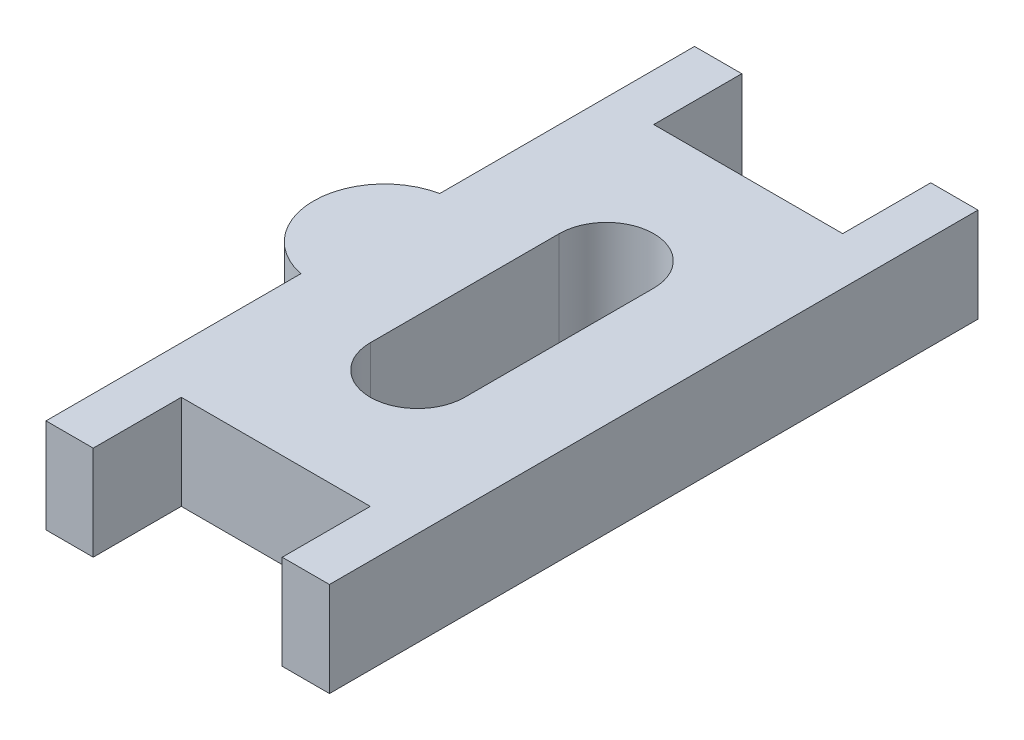
ISO-10303-21;
HEADER;
FILE_DESCRIPTION(('STEP AP214'),'2;1');
FILE_NAME('part.step','',(''),(''),'','','');
FILE_SCHEMA(('AUTOMOTIVE_DESIGN { 1 0 10303 214 1 1 1 1 }'));
ENDSEC;
DATA;
#1=APPLICATION_CONTEXT('core data for automotive mechanical design processes');
#2=APPLICATION_PROTOCOL_DEFINITION('international standard','automotive_design',2000,#1);
#3=PRODUCT_CONTEXT('',#1,'mechanical');
#4=PRODUCT('Part','Part','',(#3));
#5=PRODUCT_RELATED_PRODUCT_CATEGORY('part','',(#4));
#6=PRODUCT_DEFINITION_FORMATION('','',#4);
#7=PRODUCT_DEFINITION_CONTEXT('part definition',#1,'design');
#8=PRODUCT_DEFINITION('design','',#6,#7);
#9=PRODUCT_DEFINITION_SHAPE('','',#8);
#10=(LENGTH_UNIT() NAMED_UNIT(*) SI_UNIT(.MILLI.,.METRE.));
#11=(NAMED_UNIT(*) PLANE_ANGLE_UNIT() SI_UNIT($,.RADIAN.));
#12=(NAMED_UNIT(*) SI_UNIT($,.STERADIAN.) SOLID_ANGLE_UNIT());
#13=UNCERTAINTY_MEASURE_WITH_UNIT(LENGTH_MEASURE(1.E-05),#10,'distance_accuracy_value','');
#14=(GEOMETRIC_REPRESENTATION_CONTEXT(3) GLOBAL_UNCERTAINTY_ASSIGNED_CONTEXT((#13)) GLOBAL_UNIT_ASSIGNED_CONTEXT((#10,
#11,#12)) REPRESENTATION_CONTEXT('',''));
#15=CARTESIAN_POINT('',(0.,0.,0.));
#16=DIRECTION('',(0.,0.,1.));
#17=DIRECTION('',(1.,0.,0.));
#18=AXIS2_PLACEMENT_3D('',#15,#16,#17);
#19=CARTESIAN_POINT('',(-3.175,3.175,-10.8966));
#20=DIRECTION('',(0.,0.,1.));
#21=DIRECTION('',(1.,0.,0.));
#22=AXIS2_PLACEMENT_3D('',#19,#20,#21);
#23=PLANE('',#22);
#24=DIRECTION('',(-1.,0.,0.));
#25=VECTOR('',#24,1.);
#26=CARTESIAN_POINT('',(-3.175,0.,-10.8966));
#27=LINE('',#26,#25);
#28=CARTESIAN_POINT('',(-3.175,0.,-10.8966));
#29=VERTEX_POINT('',#28);
#30=CARTESIAN_POINT('',(-4.7625,0.,-10.8966));
#31=VERTEX_POINT('',#30);
#32=EDGE_CURVE('E171',#29,#31,#27,.T.);
#33=ORIENTED_EDGE('',*,*,#32,.T.);
#34=DIRECTION('',(0.,-1.,0.));
#35=VECTOR('',#34,1.);
#36=CARTESIAN_POINT('',(-4.7625,3.175,-10.8966));
#37=LINE('',#36,#35);
#38=CARTESIAN_POINT('',(-4.7625,3.175,-10.8966));
#39=VERTEX_POINT('',#38);
#40=EDGE_CURVE('E11',#39,#31,#37,.T.);
#41=ORIENTED_EDGE('',*,*,#40,.F.);
#42=DIRECTION('',(-1.,0.,0.));
#43=VECTOR('',#42,1.);
#44=CARTESIAN_POINT('',(-3.175,3.175,-10.8966));
#45=LINE('',#44,#43);
#46=CARTESIAN_POINT('',(-3.175,3.175,-10.8966));
#47=VERTEX_POINT('',#46);
#48=EDGE_CURVE('E194',#47,#39,#45,.T.);
#49=ORIENTED_EDGE('',*,*,#48,.F.);
#50=DIRECTION('',(0.,-1.,0.));
#51=VECTOR('',#50,1.);
#52=CARTESIAN_POINT('',(-3.175,3.175,-10.8966));
#53=LINE('',#52,#51);
#54=EDGE_CURVE('E224',#47,#29,#53,.T.);
#55=ORIENTED_EDGE('',*,*,#54,.T.);
#56=EDGE_LOOP('',(#33,#41,#49,#55));
#57=FACE_BOUND('',#56,.T.);
#58=ADVANCED_FACE('F33',(#57),#23,.F.);
#59=CARTESIAN_POINT('',(-4.7625,3.175,-10.8966));
#60=DIRECTION('',(1.,0.,0.));
#61=DIRECTION('',(0.,0.,-1.));
#62=AXIS2_PLACEMENT_3D('',#59,#60,#61);
#63=PLANE('',#62);
#64=DIRECTION('',(0.,0.,1.));
#65=VECTOR('',#64,1.);
#66=CARTESIAN_POINT('',(-4.7625,0.,-10.8966));
#67=LINE('',#66,#65);
#68=CARTESIAN_POINT('',(-4.7625,0.,-2.33313898000098));
#69=VERTEX_POINT('',#68);
#70=EDGE_CURVE('E227',#31,#69,#67,.T.);
#71=ORIENTED_EDGE('',*,*,#70,.T.);
#72=DIRECTION('',(0.,-1.,0.));
#73=VECTOR('',#72,1.);
#74=CARTESIAN_POINT('',(-4.7625,3.175,-2.33313898000098));
#75=LINE('',#74,#73);
#76=CARTESIAN_POINT('',(-4.7625,3.175,-2.33313898000098));
#77=VERTEX_POINT('',#76);
#78=EDGE_CURVE('E40',#77,#69,#75,.T.);
#79=ORIENTED_EDGE('',*,*,#78,.F.);
#80=DIRECTION('',(0.,0.,1.));
#81=VECTOR('',#80,1.);
#82=CARTESIAN_POINT('',(-4.7625,3.175,-10.8966));
#83=LINE('',#82,#81);
#84=EDGE_CURVE('E197',#39,#77,#83,.T.);
#85=ORIENTED_EDGE('',*,*,#84,.F.);
#86=ORIENTED_EDGE('',*,*,#40,.T.);
#87=EDGE_LOOP('',(#71,#79,#85,#86));
#88=FACE_BOUND('',#87,.T.);
#89=ADVANCED_FACE('F312',(#88),#63,.F.);
#90=CARTESIAN_POINT('',(-4.28625,3.175,0.));
#91=DIRECTION('',(0.,-1.,0.));
#92=DIRECTION('',(0.,0.,-1.));
#93=AXIS2_PLACEMENT_3D('',#90,#91,#92);
#94=CYLINDRICAL_SURFACE('',#93,2.38125);
#95=CARTESIAN_POINT('',(-4.28625,0.,0.));
#96=DIRECTION('',(0.,1.,0.));
#97=DIRECTION('',(0.,0.,1.));
#98=AXIS2_PLACEMENT_3D('',#95,#96,#97);
#99=CIRCLE('',#98,2.38125);
#100=CARTESIAN_POINT('',(-4.7625,0.,2.33313898000098));
#101=VERTEX_POINT('',#100);
#102=EDGE_CURVE('E229',#69,#101,#99,.T.);
#103=ORIENTED_EDGE('',*,*,#102,.T.);
#104=DIRECTION('',(0.,-1.,0.));
#105=VECTOR('',#104,1.);
#106=CARTESIAN_POINT('',(-4.7625,3.175,2.33313898000098));
#107=LINE('',#106,#105);
#108=CARTESIAN_POINT('',(-4.7625,3.175,2.33313898000098));
#109=VERTEX_POINT('',#108);
#110=EDGE_CURVE('E284',#109,#101,#107,.T.);
#111=ORIENTED_EDGE('',*,*,#110,.F.);
#112=CARTESIAN_POINT('',(-4.28625,3.175,0.));
#113=DIRECTION('',(0.,1.,0.));
#114=DIRECTION('',(0.,0.,1.));
#115=AXIS2_PLACEMENT_3D('',#112,#113,#114);
#116=CIRCLE('',#115,2.38125);
#117=EDGE_CURVE('E200',#77,#109,#116,.T.);
#118=ORIENTED_EDGE('',*,*,#117,.F.);
#119=ORIENTED_EDGE('',*,*,#78,.T.);
#120=EDGE_LOOP('',(#103,#111,#118,#119));
#121=FACE_BOUND('',#120,.T.);
#122=ADVANCED_FACE('F291',(#121),#94,.T.);
#123=CARTESIAN_POINT('',(-4.7625,3.175,10.8966));
#124=DIRECTION('',(1.,0.,0.));
#125=DIRECTION('',(0.,0.,-1.));
#126=AXIS2_PLACEMENT_3D('',#123,#124,#125);
#127=PLANE('',#126);
#128=DIRECTION('',(0.,0.,1.));
#129=VECTOR('',#128,1.);
#130=CARTESIAN_POINT('',(-4.7625,0.,10.8966));
#131=LINE('',#130,#129);
#132=CARTESIAN_POINT('',(-4.7625,0.,10.8966));
#133=VERTEX_POINT('',#132);
#134=EDGE_CURVE('E231',#101,#133,#131,.T.);
#135=ORIENTED_EDGE('',*,*,#134,.T.);
#136=DIRECTION('',(0.,-1.,0.));
#137=VECTOR('',#136,1.);
#138=CARTESIAN_POINT('',(-4.7625,3.175,10.8966));
#139=LINE('',#138,#137);
#140=CARTESIAN_POINT('',(-4.7625,3.175,10.8966));
#141=VERTEX_POINT('',#140);
#142=EDGE_CURVE('E281',#141,#133,#139,.T.);
#143=ORIENTED_EDGE('',*,*,#142,.F.);
#144=DIRECTION('',(0.,0.,1.));
#145=VECTOR('',#144,1.);
#146=CARTESIAN_POINT('',(-4.7625,3.175,10.8966));
#147=LINE('',#146,#145);
#148=EDGE_CURVE('E202',#109,#141,#147,.T.);
#149=ORIENTED_EDGE('',*,*,#148,.F.);
#150=ORIENTED_EDGE('',*,*,#110,.T.);
#151=EDGE_LOOP('',(#135,#143,#149,#150));
#152=FACE_BOUND('',#151,.T.);
#153=ADVANCED_FACE('F300',(#152),#127,.F.);
#154=CARTESIAN_POINT('',(-3.175,3.175,10.8966));
#155=DIRECTION('',(0.,0.,-1.));
#156=DIRECTION('',(-1.,0.,0.));
#157=AXIS2_PLACEMENT_3D('',#154,#155,#156);
#158=PLANE('',#157);
#159=DIRECTION('',(1.,0.,0.));
#160=VECTOR('',#159,1.);
#161=CARTESIAN_POINT('',(-3.175,0.,10.8966));
#162=LINE('',#161,#160);
#163=CARTESIAN_POINT('',(-3.175,0.,10.8966));
#164=VERTEX_POINT('',#163);
#165=EDGE_CURVE('E233',#133,#164,#162,.T.);
#166=ORIENTED_EDGE('',*,*,#165,.T.);
#167=DIRECTION('',(0.,-1.,0.));
#168=VECTOR('',#167,1.);
#169=CARTESIAN_POINT('',(-3.175,3.175,10.8966));
#170=LINE('',#169,#168);
#171=CARTESIAN_POINT('',(-3.175,3.175,10.8966));
#172=VERTEX_POINT('',#171);
#173=EDGE_CURVE('E278',#172,#164,#170,.T.);
#174=ORIENTED_EDGE('',*,*,#173,.F.);
#175=DIRECTION('',(1.,0.,0.));
#176=VECTOR('',#175,1.);
#177=CARTESIAN_POINT('',(-3.175,3.175,10.8966));
#178=LINE('',#177,#176);
#179=EDGE_CURVE('E204',#141,#172,#178,.T.);
#180=ORIENTED_EDGE('',*,*,#179,.F.);
#181=ORIENTED_EDGE('',*,*,#142,.T.);
#182=EDGE_LOOP('',(#166,#174,#180,#181));
#183=FACE_BOUND('',#182,.T.);
#184=ADVANCED_FACE('F304',(#183),#158,.F.);
#185=CARTESIAN_POINT('',(-3.175,3.175,10.8966));
#186=DIRECTION('',(-1.,0.,0.));
#187=DIRECTION('',(0.,0.,1.));
#188=AXIS2_PLACEMENT_3D('',#185,#186,#187);
#189=PLANE('',#188);
#190=DIRECTION('',(0.,0.,-1.));
#191=VECTOR('',#190,1.);
#192=CARTESIAN_POINT('',(-3.175,0.,10.8966));
#193=LINE('',#192,#191);
#194=CARTESIAN_POINT('',(-3.175,0.,7.9375));
#195=VERTEX_POINT('',#194);
#196=EDGE_CURVE('E235',#164,#195,#193,.T.);
#197=ORIENTED_EDGE('',*,*,#196,.T.);
#198=DIRECTION('',(0.,-1.,0.));
#199=VECTOR('',#198,1.);
#200=CARTESIAN_POINT('',(-3.175,3.175,7.9375));
#201=LINE('',#200,#199);
#202=CARTESIAN_POINT('',(-3.175,3.175,7.9375));
#203=VERTEX_POINT('',#202);
#204=EDGE_CURVE('E275',#203,#195,#201,.T.);
#205=ORIENTED_EDGE('',*,*,#204,.F.);
#206=DIRECTION('',(0.,0.,-1.));
#207=VECTOR('',#206,1.);
#208=CARTESIAN_POINT('',(-3.175,3.175,10.8966));
#209=LINE('',#208,#207);
#210=EDGE_CURVE('E206',#172,#203,#209,.T.);
#211=ORIENTED_EDGE('',*,*,#210,.F.);
#212=ORIENTED_EDGE('',*,*,#173,.T.);
#213=EDGE_LOOP('',(#197,#205,#211,#212));
#214=FACE_BOUND('',#213,.T.);
#215=ADVANCED_FACE('F355',(#214),#189,.F.);
#216=CARTESIAN_POINT('',(-3.175,3.175,7.9375));
#217=DIRECTION('',(0.,0.,-1.));
#218=DIRECTION('',(-1.,0.,0.));
#219=AXIS2_PLACEMENT_3D('',#216,#217,#218);
#220=PLANE('',#219);
#221=DIRECTION('',(1.,0.,0.));
#222=VECTOR('',#221,1.);
#223=CARTESIAN_POINT('',(-3.175,0.,7.9375));
#224=LINE('',#223,#222);
#225=CARTESIAN_POINT('',(3.175,0.,7.9375));
#226=VERTEX_POINT('',#225);
#227=EDGE_CURVE('E237',#195,#226,#224,.T.);
#228=ORIENTED_EDGE('',*,*,#227,.T.);
#229=DIRECTION('',(0.,-1.,0.));
#230=VECTOR('',#229,1.);
#231=CARTESIAN_POINT('',(3.175,3.175,7.9375));
#232=LINE('',#231,#230);
#233=CARTESIAN_POINT('',(3.175,3.175,7.9375));
#234=VERTEX_POINT('',#233);
#235=EDGE_CURVE('E272',#234,#226,#232,.T.);
#236=ORIENTED_EDGE('',*,*,#235,.F.);
#237=DIRECTION('',(1.,0.,0.));
#238=VECTOR('',#237,1.);
#239=CARTESIAN_POINT('',(-3.175,3.175,7.9375));
#240=LINE('',#239,#238);
#241=EDGE_CURVE('E208',#203,#234,#240,.T.);
#242=ORIENTED_EDGE('',*,*,#241,.F.);
#243=ORIENTED_EDGE('',*,*,#204,.T.);
#244=EDGE_LOOP('',(#228,#236,#242,#243));
#245=FACE_BOUND('',#244,.T.);
#246=ADVANCED_FACE('F353',(#245),#220,.F.);
#247=CARTESIAN_POINT('',(3.175,3.175,10.8966));
#248=DIRECTION('',(1.,0.,0.));
#249=DIRECTION('',(0.,0.,-1.));
#250=AXIS2_PLACEMENT_3D('',#247,#248,#249);
#251=PLANE('',#250);
#252=DIRECTION('',(0.,0.,1.));
#253=VECTOR('',#252,1.);
#254=CARTESIAN_POINT('',(3.175,0.,10.8966));
#255=LINE('',#254,#253);
#256=CARTESIAN_POINT('',(3.175,0.,10.8966));
#257=VERTEX_POINT('',#256);
#258=EDGE_CURVE('E239',#226,#257,#255,.T.);
#259=ORIENTED_EDGE('',*,*,#258,.T.);
#260=DIRECTION('',(0.,-1.,0.));
#261=VECTOR('',#260,1.);
#262=CARTESIAN_POINT('',(3.175,3.175,10.8966));
#263=LINE('',#262,#261);
#264=CARTESIAN_POINT('',(3.175,3.175,10.8966));
#265=VERTEX_POINT('',#264);
#266=EDGE_CURVE('E269',#265,#257,#263,.T.);
#267=ORIENTED_EDGE('',*,*,#266,.F.);
#268=DIRECTION('',(0.,0.,1.));
#269=VECTOR('',#268,1.);
#270=CARTESIAN_POINT('',(3.175,3.175,10.8966));
#271=LINE('',#270,#269);
#272=EDGE_CURVE('E210',#234,#265,#271,.T.);
#273=ORIENTED_EDGE('',*,*,#272,.F.);
#274=ORIENTED_EDGE('',*,*,#235,.T.);
#275=EDGE_LOOP('',(#259,#267,#273,#274));
#276=FACE_BOUND('',#275,.T.);
#277=ADVANCED_FACE('F348',(#276),#251,.F.);
#278=CARTESIAN_POINT('',(3.175,3.175,10.8966));
#279=DIRECTION('',(0.,0.,-1.));
#280=DIRECTION('',(-1.,0.,0.));
#281=AXIS2_PLACEMENT_3D('',#278,#279,#280);
#282=PLANE('',#281);
#283=DIRECTION('',(1.,0.,0.));
#284=VECTOR('',#283,1.);
#285=CARTESIAN_POINT('',(3.175,0.,10.8966));
#286=LINE('',#285,#284);
#287=CARTESIAN_POINT('',(4.7625,0.,10.8966));
#288=VERTEX_POINT('',#287);
#289=EDGE_CURVE('E241',#257,#288,#286,.T.);
#290=ORIENTED_EDGE('',*,*,#289,.T.);
#291=DIRECTION('',(0.,-1.,0.));
#292=VECTOR('',#291,1.);
#293=CARTESIAN_POINT('',(4.7625,3.175,10.8966));
#294=LINE('',#293,#292);
#295=CARTESIAN_POINT('',(4.7625,3.175,10.8966));
#296=VERTEX_POINT('',#295);
#297=EDGE_CURVE('E266',#296,#288,#294,.T.);
#298=ORIENTED_EDGE('',*,*,#297,.F.);
#299=DIRECTION('',(1.,0.,0.));
#300=VECTOR('',#299,1.);
#301=CARTESIAN_POINT('',(3.175,3.175,10.8966));
#302=LINE('',#301,#300);
#303=EDGE_CURVE('E212',#265,#296,#302,.T.);
#304=ORIENTED_EDGE('',*,*,#303,.F.);
#305=ORIENTED_EDGE('',*,*,#266,.T.);
#306=EDGE_LOOP('',(#290,#298,#304,#305));
#307=FACE_BOUND('',#306,.T.);
#308=ADVANCED_FACE('F343',(#307),#282,.F.);
#309=CARTESIAN_POINT('',(4.7625,3.175,-10.8966));
#310=DIRECTION('',(-1.,0.,0.));
#311=DIRECTION('',(0.,0.,1.));
#312=AXIS2_PLACEMENT_3D('',#309,#310,#311);
#313=PLANE('',#312);
#314=DIRECTION('',(0.,0.,-1.));
#315=VECTOR('',#314,1.);
#316=CARTESIAN_POINT('',(4.7625,0.,-10.8966));
#317=LINE('',#316,#315);
#318=CARTESIAN_POINT('',(4.7625,0.,-10.8966));
#319=VERTEX_POINT('',#318);
#320=EDGE_CURVE('E243',#288,#319,#317,.T.);
#321=ORIENTED_EDGE('',*,*,#320,.T.);
#322=DIRECTION('',(0.,-1.,0.));
#323=VECTOR('',#322,1.);
#324=CARTESIAN_POINT('',(4.7625,3.175,-10.8966));
#325=LINE('',#324,#323);
#326=CARTESIAN_POINT('',(4.7625,3.175,-10.8966));
#327=VERTEX_POINT('',#326);
#328=EDGE_CURVE('E263',#327,#319,#325,.T.);
#329=ORIENTED_EDGE('',*,*,#328,.F.);
#330=DIRECTION('',(0.,0.,-1.));
#331=VECTOR('',#330,1.);
#332=CARTESIAN_POINT('',(4.7625,3.175,-10.8966));
#333=LINE('',#332,#331);
#334=EDGE_CURVE('E214',#296,#327,#333,.T.);
#335=ORIENTED_EDGE('',*,*,#334,.F.);
#336=ORIENTED_EDGE('',*,*,#297,.T.);
#337=EDGE_LOOP('',(#321,#329,#335,#336));
#338=FACE_BOUND('',#337,.T.);
#339=ADVANCED_FACE('F339',(#338),#313,.F.);
#340=CARTESIAN_POINT('',(3.175,3.175,-10.8966));
#341=DIRECTION('',(0.,0.,1.));
#342=DIRECTION('',(1.,0.,0.));
#343=AXIS2_PLACEMENT_3D('',#340,#341,#342);
#344=PLANE('',#343);
#345=DIRECTION('',(-1.,0.,0.));
#346=VECTOR('',#345,1.);
#347=CARTESIAN_POINT('',(3.175,0.,-10.8966));
#348=LINE('',#347,#346);
#349=CARTESIAN_POINT('',(3.175,0.,-10.8966));
#350=VERTEX_POINT('',#349);
#351=EDGE_CURVE('E245',#319,#350,#348,.T.);
#352=ORIENTED_EDGE('',*,*,#351,.T.);
#353=DIRECTION('',(0.,-1.,0.));
#354=VECTOR('',#353,1.);
#355=CARTESIAN_POINT('',(3.175,3.175,-10.8966));
#356=LINE('',#355,#354);
#357=CARTESIAN_POINT('',(3.175,3.175,-10.8966));
#358=VERTEX_POINT('',#357);
#359=EDGE_CURVE('E260',#358,#350,#356,.T.);
#360=ORIENTED_EDGE('',*,*,#359,.F.);
#361=DIRECTION('',(-1.,0.,0.));
#362=VECTOR('',#361,1.);
#363=CARTESIAN_POINT('',(3.175,3.175,-10.8966));
#364=LINE('',#363,#362);
#365=EDGE_CURVE('E216',#327,#358,#364,.T.);
#366=ORIENTED_EDGE('',*,*,#365,.F.);
#367=ORIENTED_EDGE('',*,*,#328,.T.);
#368=EDGE_LOOP('',(#352,#360,#366,#367));
#369=FACE_BOUND('',#368,.T.);
#370=ADVANCED_FACE('F334',(#369),#344,.F.);
#371=CARTESIAN_POINT('',(3.175,3.175,-10.8966));
#372=DIRECTION('',(1.,0.,0.));
#373=DIRECTION('',(0.,0.,-1.));
#374=AXIS2_PLACEMENT_3D('',#371,#372,#373);
#375=PLANE('',#374);
#376=DIRECTION('',(0.,0.,1.));
#377=VECTOR('',#376,1.);
#378=CARTESIAN_POINT('',(3.175,0.,-10.8966));
#379=LINE('',#378,#377);
#380=CARTESIAN_POINT('',(3.175,0.,-7.9375));
#381=VERTEX_POINT('',#380);
#382=EDGE_CURVE('E247',#350,#381,#379,.T.);
#383=ORIENTED_EDGE('',*,*,#382,.T.);
#384=DIRECTION('',(0.,-1.,0.));
#385=VECTOR('',#384,1.);
#386=CARTESIAN_POINT('',(3.175,3.175,-7.9375));
#387=LINE('',#386,#385);
#388=CARTESIAN_POINT('',(3.175,3.175,-7.9375));
#389=VERTEX_POINT('',#388);
#390=EDGE_CURVE('E257',#389,#381,#387,.T.);
#391=ORIENTED_EDGE('',*,*,#390,.F.);
#392=DIRECTION('',(0.,0.,1.));
#393=VECTOR('',#392,1.);
#394=CARTESIAN_POINT('',(3.175,3.175,-10.8966));
#395=LINE('',#394,#393);
#396=EDGE_CURVE('E218',#358,#389,#395,.T.);
#397=ORIENTED_EDGE('',*,*,#396,.F.);
#398=ORIENTED_EDGE('',*,*,#359,.T.);
#399=EDGE_LOOP('',(#383,#391,#397,#398));
#400=FACE_BOUND('',#399,.T.);
#401=ADVANCED_FACE('F328',(#400),#375,.F.);
#402=CARTESIAN_POINT('',(-3.175,3.175,-7.9375));
#403=DIRECTION('',(0.,0.,1.));
#404=DIRECTION('',(1.,0.,0.));
#405=AXIS2_PLACEMENT_3D('',#402,#403,#404);
#406=PLANE('',#405);
#407=DIRECTION('',(-1.,0.,0.));
#408=VECTOR('',#407,1.);
#409=CARTESIAN_POINT('',(-3.175,0.,-7.9375));
#410=LINE('',#409,#408);
#411=CARTESIAN_POINT('',(-3.175,0.,-7.9375));
#412=VERTEX_POINT('',#411);
#413=EDGE_CURVE('E249',#381,#412,#410,.T.);
#414=ORIENTED_EDGE('',*,*,#413,.T.);
#415=DIRECTION('',(0.,-1.,0.));
#416=VECTOR('',#415,1.);
#417=CARTESIAN_POINT('',(-3.175,3.175,-7.9375));
#418=LINE('',#417,#416);
#419=CARTESIAN_POINT('',(-3.175,3.175,-7.9375));
#420=VERTEX_POINT('',#419);
#421=EDGE_CURVE('E254',#420,#412,#418,.T.);
#422=ORIENTED_EDGE('',*,*,#421,.F.);
#423=DIRECTION('',(-1.,0.,0.));
#424=VECTOR('',#423,1.);
#425=CARTESIAN_POINT('',(-3.175,3.175,-7.9375));
#426=LINE('',#425,#424);
#427=EDGE_CURVE('E220',#389,#420,#426,.T.);
#428=ORIENTED_EDGE('',*,*,#427,.F.);
#429=ORIENTED_EDGE('',*,*,#390,.T.);
#430=EDGE_LOOP('',(#414,#422,#428,#429));
#431=FACE_BOUND('',#430,.T.);
#432=ADVANCED_FACE('F324',(#431),#406,.F.);
#433=CARTESIAN_POINT('',(-3.175,3.175,-10.8966));
#434=DIRECTION('',(-1.,0.,0.));
#435=DIRECTION('',(0.,0.,1.));
#436=AXIS2_PLACEMENT_3D('',#433,#434,#435);
#437=PLANE('',#436);
#438=DIRECTION('',(0.,0.,-1.));
#439=VECTOR('',#438,1.);
#440=CARTESIAN_POINT('',(-3.175,0.,-10.8966));
#441=LINE('',#440,#439);
#442=EDGE_CURVE('E198',#412,#29,#441,.T.);
#443=ORIENTED_EDGE('',*,*,#442,.T.);
#444=ORIENTED_EDGE('',*,*,#54,.F.);
#445=DIRECTION('',(0.,0.,-1.));
#446=VECTOR('',#445,1.);
#447=CARTESIAN_POINT('',(-3.175,3.175,-10.8966));
#448=LINE('',#447,#446);
#449=EDGE_CURVE('E222',#420,#47,#448,.T.);
#450=ORIENTED_EDGE('',*,*,#449,.F.);
#451=ORIENTED_EDGE('',*,*,#421,.T.);
#452=EDGE_LOOP('',(#443,#444,#450,#451));
#453=FACE_BOUND('',#452,.T.);
#454=ADVANCED_FACE('F319',(#453),#437,.F.);
#455=CARTESIAN_POINT('',(-4.28625,3.175,0.));
#456=DIRECTION('',(0.,1.,0.));
#457=DIRECTION('',(0.,0.,1.));
#458=AXIS2_PLACEMENT_3D('',#455,#456,#457);
#459=PLANE('',#458);
#460=CARTESIAN_POINT('',(0.,3.175,-3.175));
#461=DIRECTION('',(0.,1.,0.));
#462=DIRECTION('',(0.,0.,1.));
#463=AXIS2_PLACEMENT_3D('',#460,#461,#462);
#464=CIRCLE('',#463,1.5875);
#465=CARTESIAN_POINT('',(1.5875,3.175,-3.175));
#466=VERTEX_POINT('',#465);
#467=CARTESIAN_POINT('',(-1.5875,3.175,-3.175));
#468=VERTEX_POINT('',#467);
#469=EDGE_CURVE('E47',#466,#468,#464,.T.);
#470=ORIENTED_EDGE('',*,*,#469,.F.);
#471=DIRECTION('',(0.,0.,-1.));
#472=VECTOR('',#471,1.);
#473=CARTESIAN_POINT('',(1.5875,3.175,-3.175));
#474=LINE('',#473,#472);
#475=CARTESIAN_POINT('',(1.5875,3.175,3.175));
#476=VERTEX_POINT('',#475);
#477=EDGE_CURVE('E165',#476,#466,#474,.T.);
#478=ORIENTED_EDGE('',*,*,#477,.F.);
#479=CARTESIAN_POINT('',(0.,3.175,3.175));
#480=DIRECTION('',(0.,1.,0.));
#481=DIRECTION('',(0.,0.,1.));
#482=AXIS2_PLACEMENT_3D('',#479,#480,#481);
#483=CIRCLE('',#482,1.5875);
#484=CARTESIAN_POINT('',(-1.5875,3.175,3.175));
#485=VERTEX_POINT('',#484);
#486=EDGE_CURVE('E185',#485,#476,#483,.T.);
#487=ORIENTED_EDGE('',*,*,#486,.F.);
#488=DIRECTION('',(0.,0.,1.));
#489=VECTOR('',#488,1.);
#490=CARTESIAN_POINT('',(-1.5875,3.175,-3.175));
#491=LINE('',#490,#489);
#492=EDGE_CURVE('E179',#468,#485,#491,.T.);
#493=ORIENTED_EDGE('',*,*,#492,.F.);
#494=EDGE_LOOP('',(#470,#478,#487,#493));
#495=FACE_BOUND('',#494,.T.);
#496=ORIENTED_EDGE('',*,*,#48,.T.);
#497=ORIENTED_EDGE('',*,*,#84,.T.);
#498=ORIENTED_EDGE('',*,*,#117,.T.);
#499=ORIENTED_EDGE('',*,*,#148,.T.);
#500=ORIENTED_EDGE('',*,*,#179,.T.);
#501=ORIENTED_EDGE('',*,*,#210,.T.);
#502=ORIENTED_EDGE('',*,*,#241,.T.);
#503=ORIENTED_EDGE('',*,*,#272,.T.);
#504=ORIENTED_EDGE('',*,*,#303,.T.);
#505=ORIENTED_EDGE('',*,*,#334,.T.);
#506=ORIENTED_EDGE('',*,*,#365,.T.);
#507=ORIENTED_EDGE('',*,*,#396,.T.);
#508=ORIENTED_EDGE('',*,*,#427,.T.);
#509=ORIENTED_EDGE('',*,*,#449,.T.);
#510=EDGE_LOOP('',(#496,#497,#498,#499,#500,#501,#502,#503,#504,#505,#506,#507,#508,#509));
#511=FACE_BOUND('',#510,.T.);
#512=ADVANCED_FACE('F308',(#495,#511),#459,.T.);
#513=CARTESIAN_POINT('',(-4.28625,0.,0.));
#514=DIRECTION('',(0.,1.,0.));
#515=DIRECTION('',(0.,0.,1.));
#516=AXIS2_PLACEMENT_3D('',#513,#514,#515);
#517=PLANE('',#516);
#518=DIRECTION('',(0.,0.,1.));
#519=VECTOR('',#518,1.);
#520=CARTESIAN_POINT('',(1.5875,0.,-3.175));
#521=LINE('',#520,#519);
#522=CARTESIAN_POINT('',(1.5875,0.,-3.175));
#523=VERTEX_POINT('',#522);
#524=CARTESIAN_POINT('',(1.5875,0.,3.175));
#525=VERTEX_POINT('',#524);
#526=EDGE_CURVE('E177',#523,#525,#521,.T.);
#527=ORIENTED_EDGE('',*,*,#526,.F.);
#528=CARTESIAN_POINT('',(0.,0.,-3.175));
#529=DIRECTION('',(0.,1.,0.));
#530=DIRECTION('',(0.,0.,1.));
#531=AXIS2_PLACEMENT_3D('',#528,#529,#530);
#532=CIRCLE('',#531,1.5875);
#533=CARTESIAN_POINT('',(-1.5875,0.,-3.175));
#534=VERTEX_POINT('',#533);
#535=EDGE_CURVE('E159',#534,#523,#532,.F.);
#536=ORIENTED_EDGE('',*,*,#535,.F.);
#537=DIRECTION('',(0.,0.,-1.));
#538=VECTOR('',#537,1.);
#539=CARTESIAN_POINT('',(-1.5875,0.,-3.175));
#540=LINE('',#539,#538);
#541=CARTESIAN_POINT('',(-1.5875,0.,3.175));
#542=VERTEX_POINT('',#541);
#543=EDGE_CURVE('E168',#542,#534,#540,.T.);
#544=ORIENTED_EDGE('',*,*,#543,.F.);
#545=CARTESIAN_POINT('',(0.,0.,3.175));
#546=DIRECTION('',(0.,1.,0.));
#547=DIRECTION('',(0.,0.,1.));
#548=AXIS2_PLACEMENT_3D('',#545,#546,#547);
#549=CIRCLE('',#548,1.5875);
#550=EDGE_CURVE('E55',#525,#542,#549,.F.);
#551=ORIENTED_EDGE('',*,*,#550,.F.);
#552=EDGE_LOOP('',(#527,#536,#544,#551));
#553=FACE_BOUND('',#552,.T.);
#554=ORIENTED_EDGE('',*,*,#32,.F.);
#555=ORIENTED_EDGE('',*,*,#442,.F.);
#556=ORIENTED_EDGE('',*,*,#413,.F.);
#557=ORIENTED_EDGE('',*,*,#382,.F.);
#558=ORIENTED_EDGE('',*,*,#351,.F.);
#559=ORIENTED_EDGE('',*,*,#320,.F.);
#560=ORIENTED_EDGE('',*,*,#289,.F.);
#561=ORIENTED_EDGE('',*,*,#258,.F.);
#562=ORIENTED_EDGE('',*,*,#227,.F.);
#563=ORIENTED_EDGE('',*,*,#196,.F.);
#564=ORIENTED_EDGE('',*,*,#165,.F.);
#565=ORIENTED_EDGE('',*,*,#134,.F.);
#566=ORIENTED_EDGE('',*,*,#102,.F.);
#567=ORIENTED_EDGE('',*,*,#70,.F.);
#568=EDGE_LOOP('',(#554,#555,#556,#557,#558,#559,#560,#561,#562,#563,#564,#565,#566,#567));
#569=FACE_BOUND('',#568,.T.);
#570=ADVANCED_FACE('F174',(#553,#569),#517,.F.);
#571=CARTESIAN_POINT('',(0.,-0.00100000000000013,-3.175));
#572=DIRECTION('',(0.,1.,0.));
#573=DIRECTION('',(0.,0.,1.));
#574=AXIS2_PLACEMENT_3D('',#571,#572,#573);
#575=CYLINDRICAL_SURFACE('',#574,1.5875);
#576=ORIENTED_EDGE('',*,*,#535,.T.);
#577=DIRECTION('',(0.,1.,0.));
#578=VECTOR('',#577,1.);
#579=CARTESIAN_POINT('',(1.5875,-0.00100000000000013,-3.175));
#580=LINE('',#579,#578);
#581=EDGE_CURVE('E172',#523,#466,#580,.T.);
#582=ORIENTED_EDGE('',*,*,#581,.T.);
#583=ORIENTED_EDGE('',*,*,#469,.T.);
#584=DIRECTION('',(0.,1.,0.));
#585=VECTOR('',#584,1.);
#586=CARTESIAN_POINT('',(-1.5875,-0.00100000000000013,-3.175));
#587=LINE('',#586,#585);
#588=EDGE_CURVE('E155',#534,#468,#587,.T.);
#589=ORIENTED_EDGE('',*,*,#588,.F.);
#590=EDGE_LOOP('',(#576,#582,#583,#589));
#591=FACE_BOUND('',#590,.T.);
#592=ADVANCED_FACE('F157',(#591),#575,.F.);
#593=CARTESIAN_POINT('',(1.5875,-0.00100000000000013,-3.175));
#594=DIRECTION('',(1.,0.,0.));
#595=DIRECTION('',(0.,0.,-1.));
#596=AXIS2_PLACEMENT_3D('',#593,#594,#595);
#597=PLANE('',#596);
#598=ORIENTED_EDGE('',*,*,#526,.T.);
#599=DIRECTION('',(0.,1.,0.));
#600=VECTOR('',#599,1.);
#601=CARTESIAN_POINT('',(1.5875,-0.00100000000000013,3.175));
#602=LINE('',#601,#600);
#603=EDGE_CURVE('E191',#525,#476,#602,.T.);
#604=ORIENTED_EDGE('',*,*,#603,.T.);
#605=ORIENTED_EDGE('',*,*,#477,.T.);
#606=ORIENTED_EDGE('',*,*,#581,.F.);
#607=EDGE_LOOP('',(#598,#604,#605,#606));
#608=FACE_BOUND('',#607,.T.);
#609=ADVANCED_FACE('F474',(#608),#597,.F.);
#610=CARTESIAN_POINT('',(0.,-0.00100000000000013,3.175));
#611=DIRECTION('',(0.,1.,0.));
#612=DIRECTION('',(0.,0.,1.));
#613=AXIS2_PLACEMENT_3D('',#610,#611,#612);
#614=CYLINDRICAL_SURFACE('',#613,1.5875);
#615=ORIENTED_EDGE('',*,*,#550,.T.);
#616=DIRECTION('',(0.,1.,0.));
#617=VECTOR('',#616,1.);
#618=CARTESIAN_POINT('',(-1.5875,-0.00100000000000013,3.175));
#619=LINE('',#618,#617);
#620=EDGE_CURVE('E164',#542,#485,#619,.T.);
#621=ORIENTED_EDGE('',*,*,#620,.T.);
#622=ORIENTED_EDGE('',*,*,#486,.T.);
#623=ORIENTED_EDGE('',*,*,#603,.F.);
#624=EDGE_LOOP('',(#615,#621,#622,#623));
#625=FACE_BOUND('',#624,.T.);
#626=ADVANCED_FACE('F483',(#625),#614,.F.);
#627=CARTESIAN_POINT('',(-1.5875,-0.00100000000000013,-3.175));
#628=DIRECTION('',(-1.,0.,0.));
#629=DIRECTION('',(0.,0.,1.));
#630=AXIS2_PLACEMENT_3D('',#627,#628,#629);
#631=PLANE('',#630);
#632=ORIENTED_EDGE('',*,*,#543,.T.);
#633=ORIENTED_EDGE('',*,*,#588,.T.);
#634=ORIENTED_EDGE('',*,*,#492,.T.);
#635=ORIENTED_EDGE('',*,*,#620,.F.);
#636=EDGE_LOOP('',(#632,#633,#634,#635));
#637=FACE_BOUND('',#636,.T.);
#638=ADVANCED_FACE('F169',(#637),#631,.F.);
#639=CLOSED_SHELL('',(#58,#89,#122,#153,#184,#215,#246,#277,#308,#339,#370,#401,#432,#454,#512,
#570,#592,#609,#626,#638));
#640=MANIFOLD_SOLID_BREP('B2',#639);
#641=ADVANCED_BREP_SHAPE_REPRESENTATION('',(#18,#640),#14);
#642=SHAPE_DEFINITION_REPRESENTATION(#9,#641);
ENDSEC;
END-ISO-10303-21;
